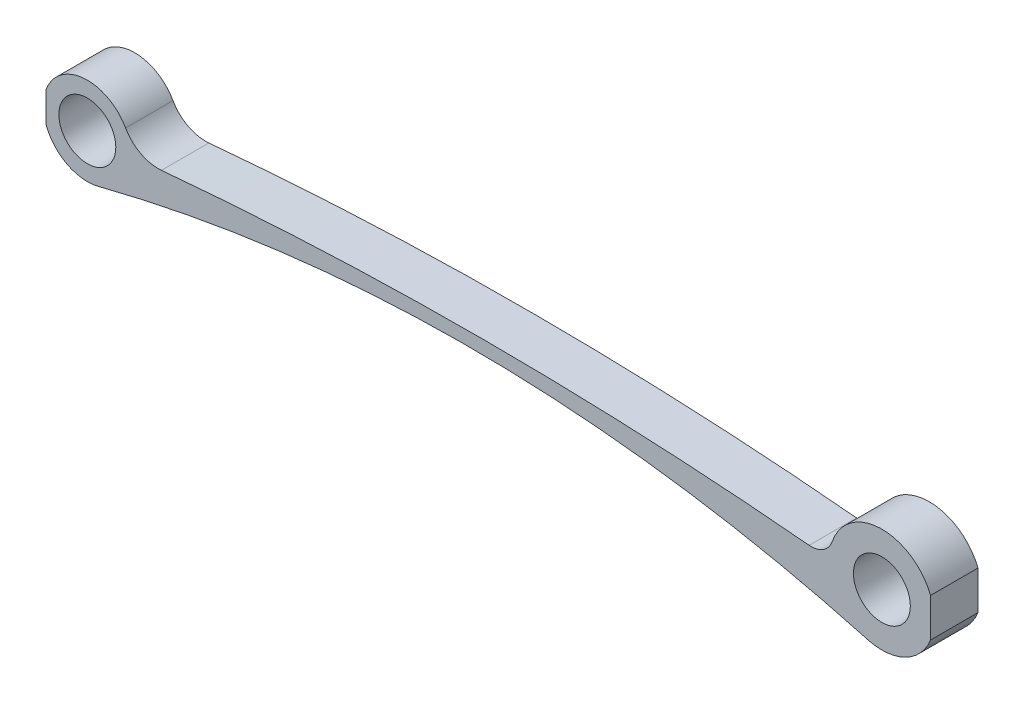
ISO-10303-21;
HEADER;
FILE_DESCRIPTION(('STEP AP214'),'2;1');
FILE_NAME('part.step','',(''),(''),'','','');
FILE_SCHEMA(('AUTOMOTIVE_DESIGN { 1 0 10303 214 1 1 1 1 }'));
ENDSEC;
DATA;
#1=APPLICATION_CONTEXT('core data for automotive mechanical design processes');
#2=APPLICATION_PROTOCOL_DEFINITION('international standard','automotive_design',2000,#1);
#3=PRODUCT_CONTEXT('',#1,'mechanical');
#4=PRODUCT('Part','Part','',(#3));
#5=PRODUCT_RELATED_PRODUCT_CATEGORY('part','',(#4));
#6=PRODUCT_DEFINITION_FORMATION('','',#4);
#7=PRODUCT_DEFINITION_CONTEXT('part definition',#1,'design');
#8=PRODUCT_DEFINITION('design','',#6,#7);
#9=PRODUCT_DEFINITION_SHAPE('','',#8);
#10=(LENGTH_UNIT() NAMED_UNIT(*) SI_UNIT(.MILLI.,.METRE.));
#11=(NAMED_UNIT(*) PLANE_ANGLE_UNIT() SI_UNIT($,.RADIAN.));
#12=(NAMED_UNIT(*) SI_UNIT($,.STERADIAN.) SOLID_ANGLE_UNIT());
#13=UNCERTAINTY_MEASURE_WITH_UNIT(LENGTH_MEASURE(1.E-05),#10,'distance_accuracy_value','');
#14=(GEOMETRIC_REPRESENTATION_CONTEXT(3) GLOBAL_UNCERTAINTY_ASSIGNED_CONTEXT((#13)) GLOBAL_UNIT_ASSIGNED_CONTEXT((#10,
#11,#12)) REPRESENTATION_CONTEXT('',''));
#15=CARTESIAN_POINT('',(0.,0.,0.));
#16=DIRECTION('',(0.,0.,1.));
#17=DIRECTION('',(1.,0.,0.));
#18=AXIS2_PLACEMENT_3D('',#15,#16,#17);
#19=CARTESIAN_POINT('',(20.0774393372365,-78.7302661466852,5.));
#20=DIRECTION('',(0.,0.,1.));
#21=DIRECTION('',(1.,0.,0.));
#22=AXIS2_PLACEMENT_3D('',#19,#20,#21);
#23=PLANE('',#22);
#24=CARTESIAN_POINT('',(0.,0.,5.));
#25=DIRECTION('',(0.,0.,1.));
#26=DIRECTION('',(1.,0.,0.));
#27=AXIS2_PLACEMENT_3D('',#24,#25,#26);
#28=CIRCLE('',#27,3.00000007924961);
#29=CARTESIAN_POINT('',(3.00000007924961,0.,5.));
#30=VERTEX_POINT('',#29);
#31=EDGE_CURVE('E182',#30,#30,#28,.T.);
#32=ORIENTED_EDGE('',*,*,#31,.F.);
#33=EDGE_LOOP('',(#32));
#34=FACE_BOUND('',#33,.T.);
#35=CARTESIAN_POINT('',(83.76241555,0.,5.));
#36=DIRECTION('',(0.,0.,1.));
#37=DIRECTION('',(1.,0.,0.));
#38=AXIS2_PLACEMENT_3D('',#35,#36,#37);
#39=CIRCLE('',#38,3.00000007924962);
#40=CARTESIAN_POINT('',(86.7624156292496,0.,5.));
#41=VERTEX_POINT('',#40);
#42=EDGE_CURVE('E212',#41,#41,#39,.T.);
#43=ORIENTED_EDGE('',*,*,#42,.F.);
#44=EDGE_LOOP('',(#43));
#45=FACE_BOUND('',#44,.T.);
#46=CARTESIAN_POINT('',(0.,0.,5.));
#47=DIRECTION('',(0.,0.,1.));
#48=DIRECTION('',(1.,0.,0.));
#49=AXIS2_PLACEMENT_3D('',#46,#47,#48);
#50=CIRCLE('',#49,4.63518821296482);
#51=CARTESIAN_POINT('',(4.03391514535895,2.28308965431751,5.));
#52=VERTEX_POINT('',#51);
#53=CARTESIAN_POINT('',(-4.35681947691644,1.58211687784739,5.));
#54=VERTEX_POINT('',#53);
#55=EDGE_CURVE('E147',#52,#54,#50,.T.);
#56=ORIENTED_EDGE('',*,*,#55,.T.);
#57=DIRECTION('',(0.,1.,0.));
#58=VECTOR('',#57,1.);
#59=CARTESIAN_POINT('',(-4.35681947691644,0.,5.));
#60=LINE('',#59,#58);
#61=CARTESIAN_POINT('',(-4.35681947691644,-1.58211687784739,5.));
#62=VERTEX_POINT('',#61);
#63=EDGE_CURVE('E117',#62,#54,#60,.T.);
#64=ORIENTED_EDGE('',*,*,#63,.F.);
#65=CARTESIAN_POINT('',(1.14538755959981,-4.49144265330439,5.));
#66=VERTEX_POINT('',#65);
#67=EDGE_CURVE('E167',#62,#66,#50,.T.);
#68=ORIENTED_EDGE('',*,*,#67,.T.);
#69=CARTESIAN_POINT('',(40.1548786744729,-157.46053229337,5.));
#70=DIRECTION('',(0.,0.,-1.));
#71=DIRECTION('',(1.,0.,0.));
#72=AXIS2_PLACEMENT_3D('',#69,#70,#71);
#73=CIRCLE('',#72,157.864761053099);
#74=CARTESIAN_POINT('',(82.2884468660165,-5.32228853526576,5.));
#75=VERTEX_POINT('',#74);
#76=EDGE_CURVE('E135',#66,#75,#73,.T.);
#77=ORIENTED_EDGE('',*,*,#76,.T.);
#78=CARTESIAN_POINT('',(83.76241555,0.,5.));
#79=DIRECTION('',(0.,0.,1.));
#80=DIRECTION('',(1.,0.,0.));
#81=AXIS2_PLACEMENT_3D('',#78,#79,#80);
#82=CIRCLE('',#81,5.5226206581645);
#83=CARTESIAN_POINT('',(88.8955383003181,-2.03725054034898,5.));
#84=VERTEX_POINT('',#83);
#85=EDGE_CURVE('E204',#75,#84,#82,.T.);
#86=ORIENTED_EDGE('',*,*,#85,.T.);
#87=DIRECTION('',(0.,-1.,0.));
#88=VECTOR('',#87,1.);
#89=CARTESIAN_POINT('',(88.8955383003181,0.,5.));
#90=LINE('',#89,#88);
#91=CARTESIAN_POINT('',(88.8955383003181,2.03725054034898,5.));
#92=VERTEX_POINT('',#91);
#93=EDGE_CURVE('E218',#92,#84,#90,.T.);
#94=ORIENTED_EDGE('',*,*,#93,.F.);
#95=CARTESIAN_POINT('',(78.537310201847,1.78818708045004,5.));
#96=VERTEX_POINT('',#95);
#97=EDGE_CURVE('E138',#92,#96,#82,.T.);
#98=ORIENTED_EDGE('',*,*,#97,.T.);
#99=CARTESIAN_POINT('',(76.3123699186025,2.54962808578346,5.));
#100=DIRECTION('',(0.,0.,-1.));
#101=DIRECTION('',(1.,0.,0.));
#102=AXIS2_PLACEMENT_3D('',#99,#100,#101);
#103=CIRCLE('',#102,2.35162745106599);
#104=CARTESIAN_POINT('',(76.0921387205939,0.208335731541776,5.));
#105=VERTEX_POINT('',#104);
#106=EDGE_CURVE('E203',#96,#105,#103,.T.);
#107=ORIENTED_EDGE('',*,*,#106,.T.);
#108=CARTESIAN_POINT('',(41.4374915524002,-368.207498117251,5.));
#109=DIRECTION('',(0.,0.,1.));
#110=DIRECTION('',(1.,0.,0.));
#111=AXIS2_PLACEMENT_3D('',#108,#109,#110);
#112=CIRCLE('',#111,370.042120846875);
#113=CARTESIAN_POINT('',(7.81361057668051,0.303839332472362,5.));
#114=VERTEX_POINT('',#113);
#115=EDGE_CURVE('E174',#105,#114,#112,.T.);
#116=ORIENTED_EDGE('',*,*,#115,.T.);
#117=CARTESIAN_POINT('',(7.45628490178643,4.22006073640343,5.));
#118=DIRECTION('',(0.,0.,-1.));
#119=DIRECTION('',(1.,0.,0.));
#120=AXIS2_PLACEMENT_3D('',#117,#118,#119);
#121=CIRCLE('',#120,3.93248925269305);
#122=EDGE_CURVE('E172',#114,#52,#121,.T.);
#123=ORIENTED_EDGE('',*,*,#122,.T.);
#124=EDGE_LOOP('',(#56,#64,#68,#77,#86,#94,#98,#107,#116,#123));
#125=FACE_BOUND('',#124,.T.);
#126=ADVANCED_FACE('F41',(#34,#45,#125),#23,.T.);
#127=CARTESIAN_POINT('',(20.0774393372365,-78.7302661466852,0.));
#128=DIRECTION('',(0.,0.,1.));
#129=DIRECTION('',(1.,0.,0.));
#130=AXIS2_PLACEMENT_3D('',#127,#128,#129);
#131=PLANE('',#130);
#132=CARTESIAN_POINT('',(0.,0.,0.));
#133=DIRECTION('',(0.,0.,1.));
#134=DIRECTION('',(1.,0.,0.));
#135=AXIS2_PLACEMENT_3D('',#132,#133,#134);
#136=CIRCLE('',#135,3.00000007924961);
#137=CARTESIAN_POINT('',(3.00000007924961,0.,0.));
#138=VERTEX_POINT('',#137);
#139=EDGE_CURVE('E209',#138,#138,#136,.T.);
#140=ORIENTED_EDGE('',*,*,#139,.T.);
#141=EDGE_LOOP('',(#140));
#142=FACE_BOUND('',#141,.T.);
#143=CARTESIAN_POINT('',(83.76241555,0.,0.));
#144=DIRECTION('',(0.,0.,1.));
#145=DIRECTION('',(1.,0.,0.));
#146=AXIS2_PLACEMENT_3D('',#143,#144,#145);
#147=CIRCLE('',#146,3.00000007924962);
#148=CARTESIAN_POINT('',(86.7624156292496,0.,0.));
#149=VERTEX_POINT('',#148);
#150=EDGE_CURVE('E215',#149,#149,#147,.T.);
#151=ORIENTED_EDGE('',*,*,#150,.T.);
#152=EDGE_LOOP('',(#151));
#153=FACE_BOUND('',#152,.T.);
#154=DIRECTION('',(0.,1.,0.));
#155=VECTOR('',#154,1.);
#156=CARTESIAN_POINT('',(-4.35681947691644,0.,0.));
#157=LINE('',#156,#155);
#158=CARTESIAN_POINT('',(-4.35681947691644,-1.58211687784739,0.));
#159=VERTEX_POINT('',#158);
#160=CARTESIAN_POINT('',(-4.35681947691644,1.58211687784739,0.));
#161=VERTEX_POINT('',#160);
#162=EDGE_CURVE('E55',#159,#161,#157,.T.);
#163=ORIENTED_EDGE('',*,*,#162,.T.);
#164=CARTESIAN_POINT('',(0.,0.,0.));
#165=DIRECTION('',(0.,0.,1.));
#166=DIRECTION('',(1.,0.,0.));
#167=AXIS2_PLACEMENT_3D('',#164,#165,#166);
#168=CIRCLE('',#167,4.63518821296482);
#169=CARTESIAN_POINT('',(4.03391514535895,2.28308965431751,0.));
#170=VERTEX_POINT('',#169);
#171=EDGE_CURVE('E127',#170,#161,#168,.T.);
#172=ORIENTED_EDGE('',*,*,#171,.F.);
#173=CARTESIAN_POINT('',(7.45628490178643,4.22006073640343,0.));
#174=DIRECTION('',(0.,0.,-1.));
#175=DIRECTION('',(1.,0.,0.));
#176=AXIS2_PLACEMENT_3D('',#173,#174,#175);
#177=CIRCLE('',#176,3.93248925269305);
#178=CARTESIAN_POINT('',(7.81361057668051,0.303839332472362,0.));
#179=VERTEX_POINT('',#178);
#180=EDGE_CURVE('E140',#179,#170,#177,.T.);
#181=ORIENTED_EDGE('',*,*,#180,.F.);
#182=CARTESIAN_POINT('',(41.4374915524002,-368.207498117251,0.));
#183=DIRECTION('',(0.,0.,1.));
#184=DIRECTION('',(1.,0.,0.));
#185=AXIS2_PLACEMENT_3D('',#182,#183,#184);
#186=CIRCLE('',#185,370.042120846875);
#187=CARTESIAN_POINT('',(76.0921387205939,0.208335731541776,0.));
#188=VERTEX_POINT('',#187);
#189=EDGE_CURVE('E187',#188,#179,#186,.T.);
#190=ORIENTED_EDGE('',*,*,#189,.F.);
#191=CARTESIAN_POINT('',(76.3123699186025,2.54962808578346,0.));
#192=DIRECTION('',(0.,0.,-1.));
#193=DIRECTION('',(1.,0.,0.));
#194=AXIS2_PLACEMENT_3D('',#191,#192,#193);
#195=CIRCLE('',#194,2.35162745106599);
#196=CARTESIAN_POINT('',(78.537310201847,1.78818708045004,0.));
#197=VERTEX_POINT('',#196);
#198=EDGE_CURVE('E186',#197,#188,#195,.T.);
#199=ORIENTED_EDGE('',*,*,#198,.F.);
#200=CARTESIAN_POINT('',(83.76241555,0.,0.));
#201=DIRECTION('',(0.,0.,1.));
#202=DIRECTION('',(1.,0.,0.));
#203=AXIS2_PLACEMENT_3D('',#200,#201,#202);
#204=CIRCLE('',#203,5.5226206581645);
#205=CARTESIAN_POINT('',(88.8955383003181,2.03725054034898,0.));
#206=VERTEX_POINT('',#205);
#207=EDGE_CURVE('E181',#206,#197,#204,.T.);
#208=ORIENTED_EDGE('',*,*,#207,.F.);
#209=DIRECTION('',(0.,-1.,0.));
#210=VECTOR('',#209,1.);
#211=CARTESIAN_POINT('',(88.8955383003181,0.,0.));
#212=LINE('',#211,#210);
#213=CARTESIAN_POINT('',(88.8955383003181,-2.03725054034898,0.));
#214=VERTEX_POINT('',#213);
#215=EDGE_CURVE('E63',#206,#214,#212,.T.);
#216=ORIENTED_EDGE('',*,*,#215,.T.);
#217=CARTESIAN_POINT('',(82.2884468660165,-5.32228853526576,0.));
#218=VERTEX_POINT('',#217);
#219=EDGE_CURVE('E183',#218,#214,#204,.T.);
#220=ORIENTED_EDGE('',*,*,#219,.F.);
#221=CARTESIAN_POINT('',(40.1548786744729,-157.46053229337,0.));
#222=DIRECTION('',(0.,0.,-1.));
#223=DIRECTION('',(1.,0.,0.));
#224=AXIS2_PLACEMENT_3D('',#221,#222,#223);
#225=CIRCLE('',#224,157.864761053099);
#226=CARTESIAN_POINT('',(1.14538755959981,-4.49144265330439,0.));
#227=VERTEX_POINT('',#226);
#228=EDGE_CURVE('E178',#227,#218,#225,.T.);
#229=ORIENTED_EDGE('',*,*,#228,.F.);
#230=EDGE_CURVE('E129',#159,#227,#168,.T.);
#231=ORIENTED_EDGE('',*,*,#230,.F.);
#232=EDGE_LOOP('',(#163,#172,#181,#190,#199,#208,#216,#220,#229,#231));
#233=FACE_BOUND('',#232,.T.);
#234=ADVANCED_FACE('F125',(#142,#153,#233),#131,.F.);
#235=CARTESIAN_POINT('',(0.,0.,5.));
#236=DIRECTION('',(0.,0.,-1.));
#237=DIRECTION('',(-1.,0.,0.));
#238=AXIS2_PLACEMENT_3D('',#235,#236,#237);
#239=CYLINDRICAL_SURFACE('',#238,4.63518821296482);
#240=DIRECTION('',(0.,0.,-1.));
#241=VECTOR('',#240,1.);
#242=CARTESIAN_POINT('',(-4.35681947691644,1.58211687784739,5.));
#243=LINE('',#242,#241);
#244=EDGE_CURVE('E11',#54,#161,#243,.T.);
#245=ORIENTED_EDGE('',*,*,#244,.F.);
#246=ORIENTED_EDGE('',*,*,#55,.F.);
#247=DIRECTION('',(0.,0.,-1.));
#248=VECTOR('',#247,1.);
#249=CARTESIAN_POINT('',(4.03391514535895,2.28308965431751,5.));
#250=LINE('',#249,#248);
#251=EDGE_CURVE('E134',#52,#170,#250,.T.);
#252=ORIENTED_EDGE('',*,*,#251,.T.);
#253=ORIENTED_EDGE('',*,*,#171,.T.);
#254=EDGE_LOOP('',(#245,#246,#252,#253));
#255=FACE_BOUND('',#254,.T.);
#256=ADVANCED_FACE('F132',(#255),#239,.T.);
#257=DIRECTION('',(0.,0.,-1.));
#258=VECTOR('',#257,1.);
#259=CARTESIAN_POINT('',(-4.35681947691644,-1.58211687784739,5.));
#260=LINE('',#259,#258);
#261=EDGE_CURVE('E49',#159,#62,#260,.F.);
#262=ORIENTED_EDGE('',*,*,#261,.F.);
#263=ORIENTED_EDGE('',*,*,#230,.T.);
#264=DIRECTION('',(0.,0.,-1.));
#265=VECTOR('',#264,1.);
#266=CARTESIAN_POINT('',(1.14538755959981,-4.49144265330439,5.));
#267=LINE('',#266,#265);
#268=EDGE_CURVE('E144',#66,#227,#267,.T.);
#269=ORIENTED_EDGE('',*,*,#268,.F.);
#270=ORIENTED_EDGE('',*,*,#67,.F.);
#271=EDGE_LOOP('',(#262,#263,#269,#270));
#272=FACE_BOUND('',#271,.T.);
#273=ADVANCED_FACE('F170',(#272),#239,.T.);
#274=CARTESIAN_POINT('',(83.76241555,0.,5.));
#275=DIRECTION('',(0.,0.,-1.));
#276=DIRECTION('',(-1.,0.,0.));
#277=AXIS2_PLACEMENT_3D('',#274,#275,#276);
#278=CYLINDRICAL_SURFACE('',#277,5.5226206581645);
#279=DIRECTION('',(0.,0.,-1.));
#280=VECTOR('',#279,1.);
#281=CARTESIAN_POINT('',(88.8955383003181,-2.03725054034898,5.));
#282=LINE('',#281,#280);
#283=EDGE_CURVE('E163',#84,#214,#282,.T.);
#284=ORIENTED_EDGE('',*,*,#283,.F.);
#285=ORIENTED_EDGE('',*,*,#85,.F.);
#286=DIRECTION('',(0.,0.,-1.));
#287=VECTOR('',#286,1.);
#288=CARTESIAN_POINT('',(82.2884468660165,-5.32228853526576,5.));
#289=LINE('',#288,#287);
#290=EDGE_CURVE('E158',#75,#218,#289,.T.);
#291=ORIENTED_EDGE('',*,*,#290,.T.);
#292=ORIENTED_EDGE('',*,*,#219,.T.);
#293=EDGE_LOOP('',(#284,#285,#291,#292));
#294=FACE_BOUND('',#293,.T.);
#295=ADVANCED_FACE('F227',(#294),#278,.T.);
#296=DIRECTION('',(0.,0.,-1.));
#297=VECTOR('',#296,1.);
#298=CARTESIAN_POINT('',(88.8955383003181,2.03725054034898,5.));
#299=LINE('',#298,#297);
#300=EDGE_CURVE('E161',#206,#92,#299,.F.);
#301=ORIENTED_EDGE('',*,*,#300,.F.);
#302=ORIENTED_EDGE('',*,*,#207,.T.);
#303=DIRECTION('',(0.,0.,-1.));
#304=VECTOR('',#303,1.);
#305=CARTESIAN_POINT('',(78.537310201847,1.78818708045004,5.));
#306=LINE('',#305,#304);
#307=EDGE_CURVE('E155',#96,#197,#306,.T.);
#308=ORIENTED_EDGE('',*,*,#307,.F.);
#309=ORIENTED_EDGE('',*,*,#97,.F.);
#310=EDGE_LOOP('',(#301,#302,#308,#309));
#311=FACE_BOUND('',#310,.T.);
#312=ADVANCED_FACE('F231',(#311),#278,.T.);
#313=CARTESIAN_POINT('',(40.1548786744729,-157.46053229337,5.));
#314=DIRECTION('',(0.,0.,-1.));
#315=DIRECTION('',(-1.,0.,0.));
#316=AXIS2_PLACEMENT_3D('',#313,#314,#315);
#317=CYLINDRICAL_SURFACE('',#316,157.864761053099);
#318=ORIENTED_EDGE('',*,*,#228,.T.);
#319=ORIENTED_EDGE('',*,*,#290,.F.);
#320=ORIENTED_EDGE('',*,*,#76,.F.);
#321=ORIENTED_EDGE('',*,*,#268,.T.);
#322=EDGE_LOOP('',(#318,#319,#320,#321));
#323=FACE_BOUND('',#322,.T.);
#324=ADVANCED_FACE('F43',(#323),#317,.F.);
#325=CARTESIAN_POINT('',(76.3123699186025,2.54962808578346,5.));
#326=DIRECTION('',(0.,0.,-1.));
#327=DIRECTION('',(-1.,0.,0.));
#328=AXIS2_PLACEMENT_3D('',#325,#326,#327);
#329=CYLINDRICAL_SURFACE('',#328,2.35162745106599);
#330=ORIENTED_EDGE('',*,*,#198,.T.);
#331=DIRECTION('',(0.,0.,-1.));
#332=VECTOR('',#331,1.);
#333=CARTESIAN_POINT('',(76.0921387205939,0.208335731541776,5.));
#334=LINE('',#333,#332);
#335=EDGE_CURVE('E152',#105,#188,#334,.T.);
#336=ORIENTED_EDGE('',*,*,#335,.F.);
#337=ORIENTED_EDGE('',*,*,#106,.F.);
#338=ORIENTED_EDGE('',*,*,#307,.T.);
#339=EDGE_LOOP('',(#330,#336,#337,#338));
#340=FACE_BOUND('',#339,.T.);
#341=ADVANCED_FACE('F198',(#340),#329,.F.);
#342=CARTESIAN_POINT('',(41.4374915524002,-368.207498117251,5.));
#343=DIRECTION('',(0.,0.,-1.));
#344=DIRECTION('',(-1.,0.,0.));
#345=AXIS2_PLACEMENT_3D('',#342,#343,#344);
#346=CYLINDRICAL_SURFACE('',#345,370.042120846875);
#347=ORIENTED_EDGE('',*,*,#189,.T.);
#348=DIRECTION('',(0.,0.,-1.));
#349=VECTOR('',#348,1.);
#350=CARTESIAN_POINT('',(7.81361057668051,0.303839332472362,5.));
#351=LINE('',#350,#349);
#352=EDGE_CURVE('E149',#114,#179,#351,.T.);
#353=ORIENTED_EDGE('',*,*,#352,.F.);
#354=ORIENTED_EDGE('',*,*,#115,.F.);
#355=ORIENTED_EDGE('',*,*,#335,.T.);
#356=EDGE_LOOP('',(#347,#353,#354,#355));
#357=FACE_BOUND('',#356,.T.);
#358=ADVANCED_FACE('F202',(#357),#346,.T.);
#359=CARTESIAN_POINT('',(7.45628490178643,4.22006073640343,5.));
#360=DIRECTION('',(0.,0.,-1.));
#361=DIRECTION('',(-1.,0.,0.));
#362=AXIS2_PLACEMENT_3D('',#359,#360,#361);
#363=CYLINDRICAL_SURFACE('',#362,3.93248925269305);
#364=ORIENTED_EDGE('',*,*,#180,.T.);
#365=ORIENTED_EDGE('',*,*,#251,.F.);
#366=ORIENTED_EDGE('',*,*,#122,.F.);
#367=ORIENTED_EDGE('',*,*,#352,.T.);
#368=EDGE_LOOP('',(#364,#365,#366,#367));
#369=FACE_BOUND('',#368,.T.);
#370=ADVANCED_FACE('F192',(#369),#363,.F.);
#371=CARTESIAN_POINT('',(0.,0.,5.));
#372=DIRECTION('',(0.,0.,-1.));
#373=DIRECTION('',(-1.,0.,0.));
#374=AXIS2_PLACEMENT_3D('',#371,#372,#373);
#375=CYLINDRICAL_SURFACE('',#374,3.00000007924961);
#376=ORIENTED_EDGE('',*,*,#31,.T.);
#377=EDGE_LOOP('',(#376));
#378=FACE_BOUND('',#377,.T.);
#379=ORIENTED_EDGE('',*,*,#139,.F.);
#380=EDGE_LOOP('',(#379));
#381=FACE_BOUND('',#380,.T.);
#382=ADVANCED_FACE('F249',(#378,#381),#375,.F.);
#383=CARTESIAN_POINT('',(83.76241555,0.,5.));
#384=DIRECTION('',(0.,0.,-1.));
#385=DIRECTION('',(-1.,0.,0.));
#386=AXIS2_PLACEMENT_3D('',#383,#384,#385);
#387=CYLINDRICAL_SURFACE('',#386,3.00000007924962);
#388=ORIENTED_EDGE('',*,*,#42,.T.);
#389=EDGE_LOOP('',(#388));
#390=FACE_BOUND('',#389,.T.);
#391=ORIENTED_EDGE('',*,*,#150,.F.);
#392=EDGE_LOOP('',(#391));
#393=FACE_BOUND('',#392,.T.);
#394=ADVANCED_FACE('F281',(#390,#393),#387,.F.);
#395=CARTESIAN_POINT('',(88.8955383003181,0.,5.));
#396=DIRECTION('',(1.,0.,0.));
#397=DIRECTION('',(0.,0.,-1.));
#398=AXIS2_PLACEMENT_3D('',#395,#396,#397);
#399=PLANE('',#398);
#400=ORIENTED_EDGE('',*,*,#283,.T.);
#401=ORIENTED_EDGE('',*,*,#215,.F.);
#402=ORIENTED_EDGE('',*,*,#300,.T.);
#403=ORIENTED_EDGE('',*,*,#93,.T.);
#404=EDGE_LOOP('',(#400,#401,#402,#403));
#405=FACE_BOUND('',#404,.T.);
#406=ADVANCED_FACE('F224',(#405),#399,.T.);
#407=CARTESIAN_POINT('',(-4.35681947691644,0.,5.));
#408=DIRECTION('',(-1.,0.,0.));
#409=DIRECTION('',(0.,0.,1.));
#410=AXIS2_PLACEMENT_3D('',#407,#408,#409);
#411=PLANE('',#410);
#412=ORIENTED_EDGE('',*,*,#244,.T.);
#413=ORIENTED_EDGE('',*,*,#162,.F.);
#414=ORIENTED_EDGE('',*,*,#261,.T.);
#415=ORIENTED_EDGE('',*,*,#63,.T.);
#416=EDGE_LOOP('',(#412,#413,#414,#415));
#417=FACE_BOUND('',#416,.T.);
#418=ADVANCED_FACE('F115',(#417),#411,.T.);
#419=CLOSED_SHELL('',(#126,#234,#256,#273,#295,#312,#324,#341,#358,#370,#382,#394,#406,#418));
#420=MANIFOLD_SOLID_BREP('B2',#419);
#421=ADVANCED_BREP_SHAPE_REPRESENTATION('',(#18,#420),#14);
#422=SHAPE_DEFINITION_REPRESENTATION(#9,#421);
ENDSEC;
END-ISO-10303-21;
